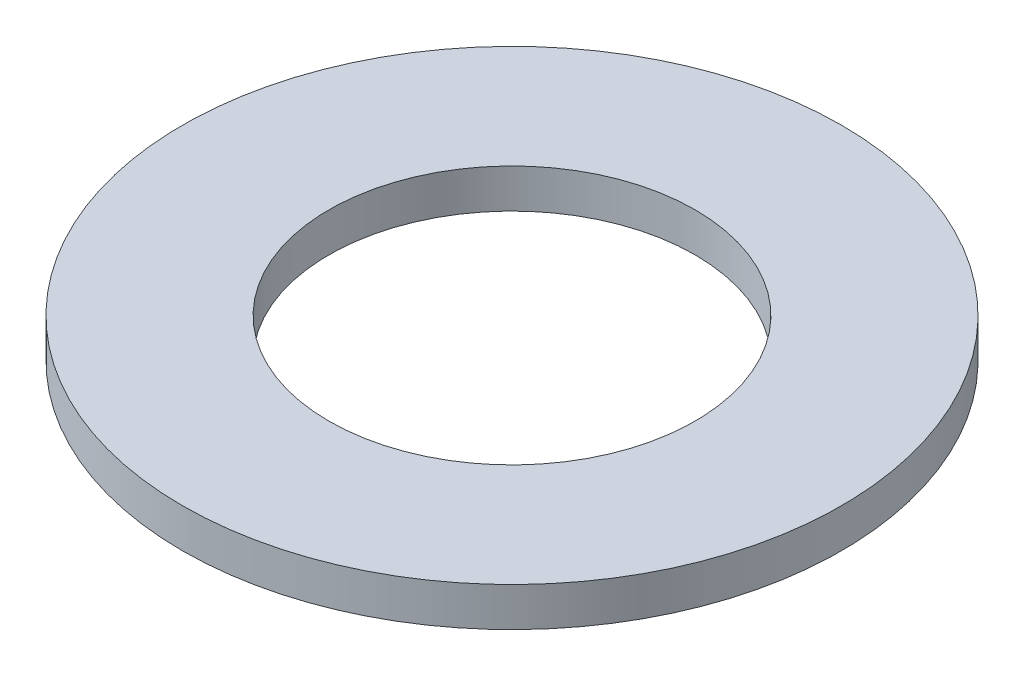
ISO-10303-21;
HEADER;
FILE_DESCRIPTION(('STEP AP214'),'2;1');
FILE_NAME('part.step','',(''),(''),'','','');
FILE_SCHEMA(('AUTOMOTIVE_DESIGN { 1 0 10303 214 1 1 1 1 }'));
ENDSEC;
DATA;
#1=APPLICATION_CONTEXT('core data for automotive mechanical design processes');
#2=APPLICATION_PROTOCOL_DEFINITION('international standard','automotive_design',2000,#1);
#3=PRODUCT_CONTEXT('',#1,'mechanical');
#4=PRODUCT('Part','Part','',(#3));
#5=PRODUCT_RELATED_PRODUCT_CATEGORY('part','',(#4));
#6=PRODUCT_DEFINITION_FORMATION('','',#4);
#7=PRODUCT_DEFINITION_CONTEXT('part definition',#1,'design');
#8=PRODUCT_DEFINITION('design','',#6,#7);
#9=PRODUCT_DEFINITION_SHAPE('','',#8);
#10=(LENGTH_UNIT() NAMED_UNIT(*) SI_UNIT(.MILLI.,.METRE.));
#11=(NAMED_UNIT(*) PLANE_ANGLE_UNIT() SI_UNIT($,.RADIAN.));
#12=(NAMED_UNIT(*) SI_UNIT($,.STERADIAN.) SOLID_ANGLE_UNIT());
#13=UNCERTAINTY_MEASURE_WITH_UNIT(LENGTH_MEASURE(1.E-05),#10,'distance_accuracy_value','');
#14=(GEOMETRIC_REPRESENTATION_CONTEXT(3) GLOBAL_UNCERTAINTY_ASSIGNED_CONTEXT((#13)) GLOBAL_UNIT_ASSIGNED_CONTEXT((#10,
#11,#12)) REPRESENTATION_CONTEXT('',''));
#15=CARTESIAN_POINT('',(0.,0.,0.));
#16=DIRECTION('',(0.,0.,1.));
#17=DIRECTION('',(1.,0.,0.));
#18=AXIS2_PLACEMENT_3D('',#15,#16,#17);
#19=CARTESIAN_POINT('',(0.,8.,0.));
#20=DIRECTION('',(0.,-1.,0.));
#21=DIRECTION('',(0.,0.,-1.));
#22=AXIS2_PLACEMENT_3D('',#19,#20,#21);
#23=CYLINDRICAL_SURFACE('',#22,67.5);
#24=CARTESIAN_POINT('',(0.,8.,0.));
#25=DIRECTION('',(0.,1.,0.));
#26=DIRECTION('',(0.,0.,1.));
#27=AXIS2_PLACEMENT_3D('',#24,#25,#26);
#28=CIRCLE('',#27,67.5);
#29=CARTESIAN_POINT('',(0.,8.,67.5));
#30=VERTEX_POINT('',#29);
#31=EDGE_CURVE('E10',#30,#30,#28,.T.);
#32=ORIENTED_EDGE('',*,*,#31,.F.);
#33=EDGE_LOOP('',(#32));
#34=FACE_BOUND('',#33,.T.);
#35=CARTESIAN_POINT('',(0.,0.,0.));
#36=DIRECTION('',(0.,1.,0.));
#37=DIRECTION('',(0.,0.,1.));
#38=AXIS2_PLACEMENT_3D('',#35,#36,#37);
#39=CIRCLE('',#38,67.5);
#40=CARTESIAN_POINT('',(0.,0.,67.5));
#41=VERTEX_POINT('',#40);
#42=EDGE_CURVE('E37',#41,#41,#39,.T.);
#43=ORIENTED_EDGE('',*,*,#42,.T.);
#44=EDGE_LOOP('',(#43));
#45=FACE_BOUND('',#44,.T.);
#46=ADVANCED_FACE('F40',(#34,#45),#23,.T.);
#47=CARTESIAN_POINT('',(0.,8.,0.));
#48=DIRECTION('',(0.,1.,0.));
#49=DIRECTION('',(0.,0.,1.));
#50=AXIS2_PLACEMENT_3D('',#47,#48,#49);
#51=PLANE('',#50);
#52=CARTESIAN_POINT('',(0.,8.,0.));
#53=DIRECTION('',(0.,1.,0.));
#54=DIRECTION('',(0.,0.,1.));
#55=AXIS2_PLACEMENT_3D('',#52,#53,#54);
#56=CIRCLE('',#55,37.5);
#57=CARTESIAN_POINT('',(0.,8.,37.5));
#58=VERTEX_POINT('',#57);
#59=EDGE_CURVE('E50',#58,#58,#56,.T.);
#60=ORIENTED_EDGE('',*,*,#59,.F.);
#61=EDGE_LOOP('',(#60));
#62=FACE_BOUND('',#61,.T.);
#63=ORIENTED_EDGE('',*,*,#31,.T.);
#64=EDGE_LOOP('',(#63));
#65=FACE_BOUND('',#64,.T.);
#66=ADVANCED_FACE('F59',(#62,#65),#51,.T.);
#67=CARTESIAN_POINT('',(0.,0.,0.));
#68=DIRECTION('',(0.,1.,0.));
#69=DIRECTION('',(0.,0.,1.));
#70=AXIS2_PLACEMENT_3D('',#67,#68,#69);
#71=PLANE('',#70);
#72=CARTESIAN_POINT('',(0.,0.,0.));
#73=DIRECTION('',(0.,1.,0.));
#74=DIRECTION('',(0.,0.,1.));
#75=AXIS2_PLACEMENT_3D('',#72,#73,#74);
#76=CIRCLE('',#75,37.5);
#77=CARTESIAN_POINT('',(0.,0.,37.5));
#78=VERTEX_POINT('',#77);
#79=EDGE_CURVE('E47',#78,#78,#76,.T.);
#80=ORIENTED_EDGE('',*,*,#79,.T.);
#81=EDGE_LOOP('',(#80));
#82=FACE_BOUND('',#81,.T.);
#83=ORIENTED_EDGE('',*,*,#42,.F.);
#84=EDGE_LOOP('',(#83));
#85=FACE_BOUND('',#84,.T.);
#86=ADVANCED_FACE('F58',(#82,#85),#71,.F.);
#87=CARTESIAN_POINT('',(0.,8.,0.));
#88=DIRECTION('',(0.,-1.,0.));
#89=DIRECTION('',(0.,0.,-1.));
#90=AXIS2_PLACEMENT_3D('',#87,#88,#89);
#91=CYLINDRICAL_SURFACE('',#90,37.5);
#92=ORIENTED_EDGE('',*,*,#59,.T.);
#93=EDGE_LOOP('',(#92));
#94=FACE_BOUND('',#93,.T.);
#95=ORIENTED_EDGE('',*,*,#79,.F.);
#96=EDGE_LOOP('',(#95));
#97=FACE_BOUND('',#96,.T.);
#98=ADVANCED_FACE('F54',(#94,#97),#91,.F.);
#99=CLOSED_SHELL('',(#46,#66,#86,#98));
#100=MANIFOLD_SOLID_BREP('B2',#99);
#101=ADVANCED_BREP_SHAPE_REPRESENTATION('',(#18,#100),#14);
#102=SHAPE_DEFINITION_REPRESENTATION(#9,#101);
ENDSEC;
END-ISO-10303-21;
